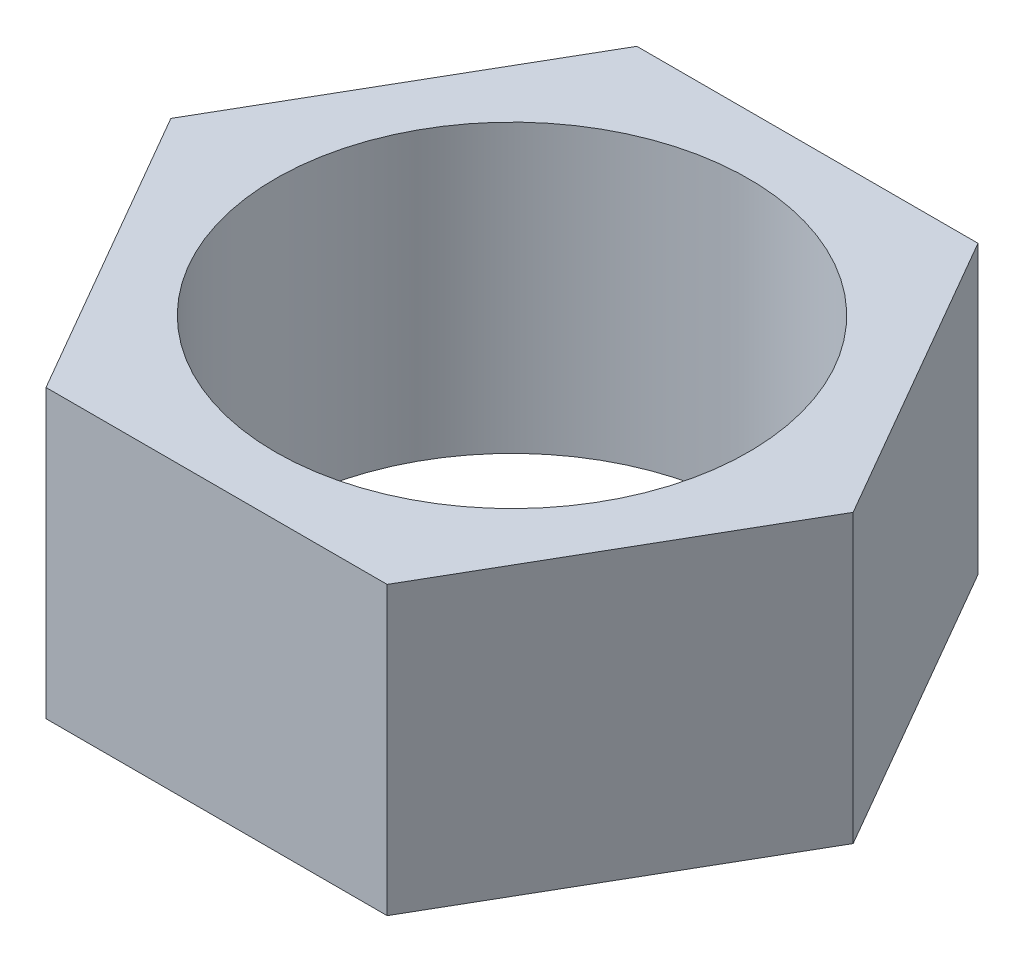
ISO-10303-21;
HEADER;
FILE_DESCRIPTION(('STEP AP214'),'2;1');
FILE_NAME('part.step','',(''),(''),'','','');
FILE_SCHEMA(('AUTOMOTIVE_DESIGN { 1 0 10303 214 1 1 1 1 }'));
ENDSEC;
DATA;
#1=APPLICATION_CONTEXT('core data for automotive mechanical design processes');
#2=APPLICATION_PROTOCOL_DEFINITION('international standard','automotive_design',2000,#1);
#3=PRODUCT_CONTEXT('',#1,'mechanical');
#4=PRODUCT('Part','Part','',(#3));
#5=PRODUCT_RELATED_PRODUCT_CATEGORY('part','',(#4));
#6=PRODUCT_DEFINITION_FORMATION('','',#4);
#7=PRODUCT_DEFINITION_CONTEXT('part definition',#1,'design');
#8=PRODUCT_DEFINITION('design','',#6,#7);
#9=PRODUCT_DEFINITION_SHAPE('','',#8);
#10=(LENGTH_UNIT() NAMED_UNIT(*) SI_UNIT(.MILLI.,.METRE.));
#11=(NAMED_UNIT(*) PLANE_ANGLE_UNIT() SI_UNIT($,.RADIAN.));
#12=(NAMED_UNIT(*) SI_UNIT($,.STERADIAN.) SOLID_ANGLE_UNIT());
#13=UNCERTAINTY_MEASURE_WITH_UNIT(LENGTH_MEASURE(1.E-05),#10,'distance_accuracy_value','');
#14=(GEOMETRIC_REPRESENTATION_CONTEXT(3) GLOBAL_UNCERTAINTY_ASSIGNED_CONTEXT((#13)) GLOBAL_UNIT_ASSIGNED_CONTEXT((#10,
#11,#12)) REPRESENTATION_CONTEXT('',''));
#15=CARTESIAN_POINT('',(0.,0.,0.));
#16=DIRECTION('',(0.,0.,1.));
#17=DIRECTION('',(1.,0.,0.));
#18=AXIS2_PLACEMENT_3D('',#15,#16,#17);
#19=CARTESIAN_POINT('',(0.,2.,0.));
#20=DIRECTION('',(0.,1.,0.));
#21=DIRECTION('',(0.,0.,1.));
#22=AXIS2_PLACEMENT_3D('',#19,#20,#21);
#23=PLANE('',#22);
#24=DIRECTION('',(0.499999999999995,0.,-0.866025403784442));
#25=VECTOR('',#24,1.);
#26=CARTESIAN_POINT('',(1.18908311534441,2.,2.05955237019875));
#27=LINE('',#26,#25);
#28=CARTESIAN_POINT('',(1.18908311534441,2.,2.05955237019875));
#29=VERTEX_POINT('',#28);
#30=CARTESIAN_POINT('',(2.37816623068878,2.,0.));
#31=VERTEX_POINT('',#30);
#32=EDGE_CURVE('E129',#29,#31,#27,.T.);
#33=ORIENTED_EDGE('',*,*,#32,.T.);
#34=DIRECTION('',(-0.500000000000001,0.,-0.866025403784438));
#35=VECTOR('',#34,1.);
#36=CARTESIAN_POINT('',(2.37816623068878,2.,0.));
#37=LINE('',#36,#35);
#38=CARTESIAN_POINT('',(1.18908311534438,2.,-2.05955237019877));
#39=VERTEX_POINT('',#38);
#40=EDGE_CURVE('E87',#31,#39,#37,.T.);
#41=ORIENTED_EDGE('',*,*,#40,.T.);
#42=DIRECTION('',(-1.,0.,0.));
#43=VECTOR('',#42,1.);
#44=CARTESIAN_POINT('',(1.18908311534438,2.,-2.05955237019877));
#45=LINE('',#44,#43);
#46=CARTESIAN_POINT('',(-1.1890831153444,2.,-2.05955237019876));
#47=VERTEX_POINT('',#46);
#48=EDGE_CURVE('E100',#39,#47,#45,.T.);
#49=ORIENTED_EDGE('',*,*,#48,.T.);
#50=DIRECTION('',(-0.499999999999995,0.,0.866025403784442));
#51=VECTOR('',#50,1.);
#52=CARTESIAN_POINT('',(-1.1890831153444,2.,-2.05955237019876));
#53=LINE('',#52,#51);
#54=CARTESIAN_POINT('',(-2.37816623068878,2.,0.));
#55=VERTEX_POINT('',#54);
#56=EDGE_CURVE('E94',#47,#55,#53,.T.);
#57=ORIENTED_EDGE('',*,*,#56,.T.);
#58=DIRECTION('',(0.500000000000007,0.,0.866025403784435));
#59=VECTOR('',#58,1.);
#60=CARTESIAN_POINT('',(-2.37816623068878,2.,0.));
#61=LINE('',#60,#59);
#62=CARTESIAN_POINT('',(-1.18908311534437,2.,2.05955237019878));
#63=VERTEX_POINT('',#62);
#64=EDGE_CURVE('E98',#55,#63,#61,.T.);
#65=ORIENTED_EDGE('',*,*,#64,.T.);
#66=DIRECTION('',(1.,0.,0.));
#67=VECTOR('',#66,1.);
#68=CARTESIAN_POINT('',(-1.18908311534437,2.,2.05955237019878));
#69=LINE('',#68,#67);
#70=EDGE_CURVE('E50',#63,#29,#69,.T.);
#71=ORIENTED_EDGE('',*,*,#70,.T.);
#72=EDGE_LOOP('',(#33,#41,#49,#57,#65,#71));
#73=FACE_BOUND('',#72,.T.);
#74=CARTESIAN_POINT('',(0.,2.,0.));
#75=DIRECTION('',(0.,1.,0.));
#76=DIRECTION('',(0.,0.,1.));
#77=AXIS2_PLACEMENT_3D('',#74,#75,#76);
#78=CIRCLE('',#77,1.65);
#79=CARTESIAN_POINT('',(0.,2.,1.65));
#80=VERTEX_POINT('',#79);
#81=EDGE_CURVE('E122',#80,#80,#78,.T.);
#82=ORIENTED_EDGE('',*,*,#81,.F.);
#83=EDGE_LOOP('',(#82));
#84=FACE_BOUND('',#83,.T.);
#85=ADVANCED_FACE('F33',(#73,#84),#23,.T.);
#86=CARTESIAN_POINT('',(0.,0.,0.));
#87=DIRECTION('',(0.,1.,0.));
#88=DIRECTION('',(0.,0.,1.));
#89=AXIS2_PLACEMENT_3D('',#86,#87,#88);
#90=PLANE('',#89);
#91=DIRECTION('',(0.499999999999995,0.,-0.866025403784442));
#92=VECTOR('',#91,1.);
#93=CARTESIAN_POINT('',(1.18908311534441,0.,2.05955237019875));
#94=LINE('',#93,#92);
#95=CARTESIAN_POINT('',(1.18908311534441,0.,2.05955237019875));
#96=VERTEX_POINT('',#95);
#97=CARTESIAN_POINT('',(2.37816623068878,0.,0.));
#98=VERTEX_POINT('',#97);
#99=EDGE_CURVE('E118',#96,#98,#94,.T.);
#100=ORIENTED_EDGE('',*,*,#99,.F.);
#101=DIRECTION('',(1.,0.,0.));
#102=VECTOR('',#101,1.);
#103=CARTESIAN_POINT('',(-1.18908311534437,0.,2.05955237019878));
#104=LINE('',#103,#102);
#105=CARTESIAN_POINT('',(-1.18908311534437,0.,2.05955237019878));
#106=VERTEX_POINT('',#105);
#107=EDGE_CURVE('E79',#106,#96,#104,.T.);
#108=ORIENTED_EDGE('',*,*,#107,.F.);
#109=DIRECTION('',(0.500000000000007,0.,0.866025403784435));
#110=VECTOR('',#109,1.);
#111=CARTESIAN_POINT('',(-2.37816623068878,0.,0.));
#112=LINE('',#111,#110);
#113=CARTESIAN_POINT('',(-2.37816623068878,0.,0.));
#114=VERTEX_POINT('',#113);
#115=EDGE_CURVE('E73',#114,#106,#112,.T.);
#116=ORIENTED_EDGE('',*,*,#115,.F.);
#117=DIRECTION('',(-0.499999999999995,0.,0.866025403784442));
#118=VECTOR('',#117,1.);
#119=CARTESIAN_POINT('',(-1.1890831153444,0.,-2.05955237019876));
#120=LINE('',#119,#118);
#121=CARTESIAN_POINT('',(-1.1890831153444,0.,-2.05955237019876));
#122=VERTEX_POINT('',#121);
#123=EDGE_CURVE('E108',#122,#114,#120,.T.);
#124=ORIENTED_EDGE('',*,*,#123,.F.);
#125=DIRECTION('',(-1.,0.,0.));
#126=VECTOR('',#125,1.);
#127=CARTESIAN_POINT('',(1.18908311534438,0.,-2.05955237019877));
#128=LINE('',#127,#126);
#129=CARTESIAN_POINT('',(1.18908311534438,0.,-2.05955237019877));
#130=VERTEX_POINT('',#129);
#131=EDGE_CURVE('E124',#130,#122,#128,.T.);
#132=ORIENTED_EDGE('',*,*,#131,.F.);
#133=DIRECTION('',(-0.500000000000001,0.,-0.866025403784438));
#134=VECTOR('',#133,1.);
#135=CARTESIAN_POINT('',(2.37816623068878,0.,0.));
#136=LINE('',#135,#134);
#137=EDGE_CURVE('E121',#98,#130,#136,.T.);
#138=ORIENTED_EDGE('',*,*,#137,.F.);
#139=EDGE_LOOP('',(#100,#108,#116,#124,#132,#138));
#140=FACE_BOUND('',#139,.T.);
#141=CARTESIAN_POINT('',(0.,0.,0.));
#142=DIRECTION('',(0.,1.,0.));
#143=DIRECTION('',(0.,0.,1.));
#144=AXIS2_PLACEMENT_3D('',#141,#142,#143);
#145=CIRCLE('',#144,1.65);
#146=CARTESIAN_POINT('',(0.,0.,1.65));
#147=VERTEX_POINT('',#146);
#148=EDGE_CURVE('E222',#147,#147,#145,.T.);
#149=ORIENTED_EDGE('',*,*,#148,.T.);
#150=EDGE_LOOP('',(#149));
#151=FACE_BOUND('',#150,.T.);
#152=ADVANCED_FACE('F138',(#140,#151),#90,.F.);
#153=CARTESIAN_POINT('',(1.18908311534441,2.,2.05955237019875));
#154=DIRECTION('',(-0.866025403784442,0.,-0.499999999999995));
#155=DIRECTION('',(-0.499999999999995,0.,0.866025403784442));
#156=AXIS2_PLACEMENT_3D('',#153,#154,#155);
#157=PLANE('',#156);
#158=ORIENTED_EDGE('',*,*,#99,.T.);
#159=DIRECTION('',(0.,-1.,0.));
#160=VECTOR('',#159,1.);
#161=CARTESIAN_POINT('',(2.37816623068878,2.,0.));
#162=LINE('',#161,#160);
#163=EDGE_CURVE('E11',#31,#98,#162,.T.);
#164=ORIENTED_EDGE('',*,*,#163,.F.);
#165=ORIENTED_EDGE('',*,*,#32,.F.);
#166=DIRECTION('',(0.,-1.,0.));
#167=VECTOR('',#166,1.);
#168=CARTESIAN_POINT('',(1.18908311534441,2.,2.05955237019875));
#169=LINE('',#168,#167);
#170=EDGE_CURVE('E114',#29,#96,#169,.T.);
#171=ORIENTED_EDGE('',*,*,#170,.T.);
#172=EDGE_LOOP('',(#158,#164,#165,#171));
#173=FACE_BOUND('',#172,.T.);
#174=ADVANCED_FACE('F35',(#173),#157,.F.);
#175=CARTESIAN_POINT('',(2.37816623068878,2.,0.));
#176=DIRECTION('',(-0.866025403784438,0.,0.500000000000001));
#177=DIRECTION('',(0.500000000000001,0.,0.866025403784438));
#178=AXIS2_PLACEMENT_3D('',#175,#176,#177);
#179=PLANE('',#178);
#180=ORIENTED_EDGE('',*,*,#137,.T.);
#181=DIRECTION('',(0.,-1.,0.));
#182=VECTOR('',#181,1.);
#183=CARTESIAN_POINT('',(1.18908311534438,2.,-2.05955237019877));
#184=LINE('',#183,#182);
#185=EDGE_CURVE('E42',#39,#130,#184,.T.);
#186=ORIENTED_EDGE('',*,*,#185,.F.);
#187=ORIENTED_EDGE('',*,*,#40,.F.);
#188=ORIENTED_EDGE('',*,*,#163,.T.);
#189=EDGE_LOOP('',(#180,#186,#187,#188));
#190=FACE_BOUND('',#189,.T.);
#191=ADVANCED_FACE('F163',(#190),#179,.F.);
#192=CARTESIAN_POINT('',(1.18908311534438,2.,-2.05955237019877));
#193=DIRECTION('',(0.,0.,1.));
#194=DIRECTION('',(1.,0.,0.));
#195=AXIS2_PLACEMENT_3D('',#192,#193,#194);
#196=PLANE('',#195);
#197=ORIENTED_EDGE('',*,*,#131,.T.);
#198=DIRECTION('',(0.,-1.,0.));
#199=VECTOR('',#198,1.);
#200=CARTESIAN_POINT('',(-1.1890831153444,2.,-2.05955237019876));
#201=LINE('',#200,#199);
#202=EDGE_CURVE('E109',#47,#122,#201,.T.);
#203=ORIENTED_EDGE('',*,*,#202,.F.);
#204=ORIENTED_EDGE('',*,*,#48,.F.);
#205=ORIENTED_EDGE('',*,*,#185,.T.);
#206=EDGE_LOOP('',(#197,#203,#204,#205));
#207=FACE_BOUND('',#206,.T.);
#208=ADVANCED_FACE('F135',(#207),#196,.F.);
#209=CARTESIAN_POINT('',(-1.1890831153444,2.,-2.05955237019876));
#210=DIRECTION('',(0.866025403784442,0.,0.499999999999995));
#211=DIRECTION('',(0.499999999999995,0.,-0.866025403784442));
#212=AXIS2_PLACEMENT_3D('',#209,#210,#211);
#213=PLANE('',#212);
#214=ORIENTED_EDGE('',*,*,#123,.T.);
#215=DIRECTION('',(0.,-1.,0.));
#216=VECTOR('',#215,1.);
#217=CARTESIAN_POINT('',(-2.37816623068878,2.,0.));
#218=LINE('',#217,#216);
#219=EDGE_CURVE('E105',#55,#114,#218,.T.);
#220=ORIENTED_EDGE('',*,*,#219,.F.);
#221=ORIENTED_EDGE('',*,*,#56,.F.);
#222=ORIENTED_EDGE('',*,*,#202,.T.);
#223=EDGE_LOOP('',(#214,#220,#221,#222));
#224=FACE_BOUND('',#223,.T.);
#225=ADVANCED_FACE('F106',(#224),#213,.F.);
#226=CARTESIAN_POINT('',(-2.37816623068878,2.,0.));
#227=DIRECTION('',(0.866025403784434,0.,-0.500000000000007));
#228=DIRECTION('',(-0.500000000000007,0.,-0.866025403784435));
#229=AXIS2_PLACEMENT_3D('',#226,#227,#228);
#230=PLANE('',#229);
#231=ORIENTED_EDGE('',*,*,#115,.T.);
#232=DIRECTION('',(0.,-1.,0.));
#233=VECTOR('',#232,1.);
#234=CARTESIAN_POINT('',(-1.18908311534437,2.,2.05955237019878));
#235=LINE('',#234,#233);
#236=EDGE_CURVE('E110',#63,#106,#235,.T.);
#237=ORIENTED_EDGE('',*,*,#236,.F.);
#238=ORIENTED_EDGE('',*,*,#64,.F.);
#239=ORIENTED_EDGE('',*,*,#219,.T.);
#240=EDGE_LOOP('',(#231,#237,#238,#239));
#241=FACE_BOUND('',#240,.T.);
#242=ADVANCED_FACE('F112',(#241),#230,.F.);
#243=CARTESIAN_POINT('',(-1.18908311534437,2.,2.05955237019878));
#244=DIRECTION('',(0.,0.,-1.));
#245=DIRECTION('',(-1.,0.,0.));
#246=AXIS2_PLACEMENT_3D('',#243,#244,#245);
#247=PLANE('',#246);
#248=ORIENTED_EDGE('',*,*,#107,.T.);
#249=ORIENTED_EDGE('',*,*,#170,.F.);
#250=ORIENTED_EDGE('',*,*,#70,.F.);
#251=ORIENTED_EDGE('',*,*,#236,.T.);
#252=EDGE_LOOP('',(#248,#249,#250,#251));
#253=FACE_BOUND('',#252,.T.);
#254=ADVANCED_FACE('F143',(#253),#247,.F.);
#255=CARTESIAN_POINT('',(0.,2.,0.));
#256=DIRECTION('',(0.,-1.,0.));
#257=DIRECTION('',(0.,0.,-1.));
#258=AXIS2_PLACEMENT_3D('',#255,#256,#257);
#259=CYLINDRICAL_SURFACE('',#258,1.65);
#260=ORIENTED_EDGE('',*,*,#81,.T.);
#261=EDGE_LOOP('',(#260));
#262=FACE_BOUND('',#261,.T.);
#263=ORIENTED_EDGE('',*,*,#148,.F.);
#264=EDGE_LOOP('',(#263));
#265=FACE_BOUND('',#264,.T.);
#266=ADVANCED_FACE('F145',(#262,#265),#259,.F.);
#267=CLOSED_SHELL('',(#85,#152,#174,#191,#208,#225,#242,#254,#266));
#268=MANIFOLD_SOLID_BREP('B2',#267);
#269=ADVANCED_BREP_SHAPE_REPRESENTATION('',(#18,#268),#14);
#270=SHAPE_DEFINITION_REPRESENTATION(#9,#269);
ENDSEC;
END-ISO-10303-21;
